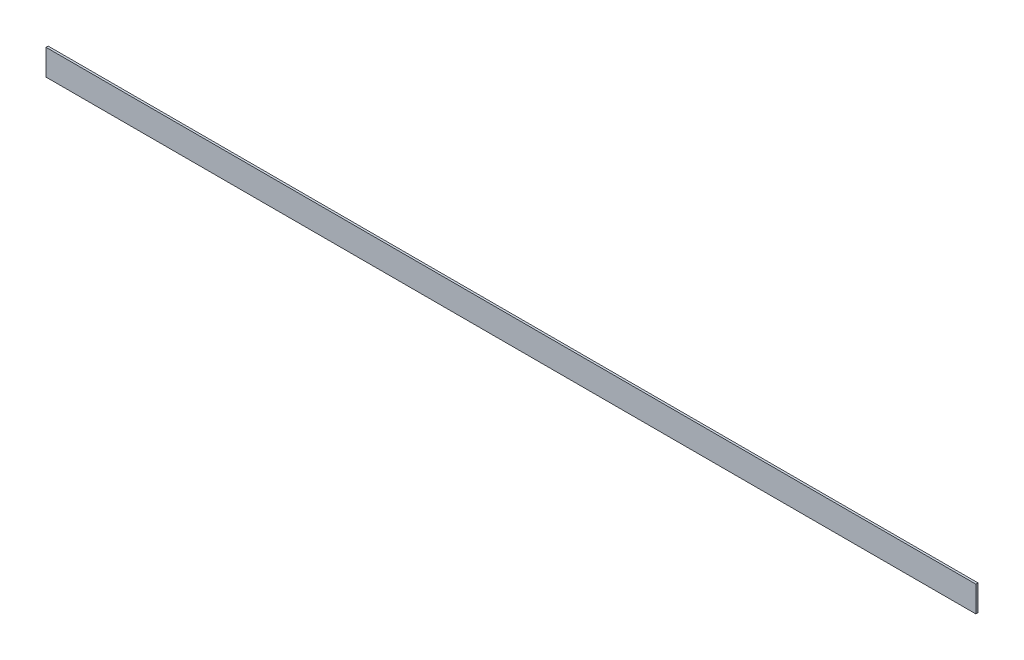
ISO-10303-21;
HEADER;
FILE_DESCRIPTION(('STEP AP214'),'2;1');
FILE_NAME('part.step','',(''),(''),'','','');
FILE_SCHEMA(('AUTOMOTIVE_DESIGN { 1 0 10303 214 1 1 1 1 }'));
ENDSEC;
DATA;
#1=APPLICATION_CONTEXT('core data for automotive mechanical design processes');
#2=APPLICATION_PROTOCOL_DEFINITION('international standard','automotive_design',2000,#1);
#3=PRODUCT_CONTEXT('',#1,'mechanical');
#4=PRODUCT('Part','Part','',(#3));
#5=PRODUCT_RELATED_PRODUCT_CATEGORY('part','',(#4));
#6=PRODUCT_DEFINITION_FORMATION('','',#4);
#7=PRODUCT_DEFINITION_CONTEXT('part definition',#1,'design');
#8=PRODUCT_DEFINITION('design','',#6,#7);
#9=PRODUCT_DEFINITION_SHAPE('','',#8);
#10=(LENGTH_UNIT() NAMED_UNIT(*) SI_UNIT(.MILLI.,.METRE.));
#11=(NAMED_UNIT(*) PLANE_ANGLE_UNIT() SI_UNIT($,.RADIAN.));
#12=(NAMED_UNIT(*) SI_UNIT($,.STERADIAN.) SOLID_ANGLE_UNIT());
#13=UNCERTAINTY_MEASURE_WITH_UNIT(LENGTH_MEASURE(1.E-05),#10,'distance_accuracy_value','');
#14=(GEOMETRIC_REPRESENTATION_CONTEXT(3) GLOBAL_UNCERTAINTY_ASSIGNED_CONTEXT((#13)) GLOBAL_UNIT_ASSIGNED_CONTEXT((#10,
#11,#12)) REPRESENTATION_CONTEXT('',''));
#15=CARTESIAN_POINT('',(0.,0.,0.));
#16=DIRECTION('',(0.,0.,1.));
#17=DIRECTION('',(1.,0.,0.));
#18=AXIS2_PLACEMENT_3D('',#15,#16,#17);
#19=CARTESIAN_POINT('',(2743.2,-38.1,-3.175));
#20=DIRECTION('',(0.,0.,1.));
#21=DIRECTION('',(1.,0.,0.));
#22=AXIS2_PLACEMENT_3D('',#19,#20,#21);
#23=PLANE('',#22);
#24=DIRECTION('',(0.,1.,0.));
#25=VECTOR('',#24,1.);
#26=CARTESIAN_POINT('',(0.,-38.1,-3.175));
#27=LINE('',#26,#25);
#28=CARTESIAN_POINT('',(0.,-38.1,-3.175));
#29=VERTEX_POINT('',#28);
#30=CARTESIAN_POINT('',(0.,38.1,-3.175));
#31=VERTEX_POINT('',#30);
#32=EDGE_CURVE('E98',#29,#31,#27,.T.);
#33=ORIENTED_EDGE('',*,*,#32,.T.);
#34=DIRECTION('',(-1.,0.,0.));
#35=VECTOR('',#34,1.);
#36=CARTESIAN_POINT('',(2743.2,38.1,-3.175));
#37=LINE('',#36,#35);
#38=CARTESIAN_POINT('',(2743.2,38.1,-3.175));
#39=VERTEX_POINT('',#38);
#40=EDGE_CURVE('E11',#39,#31,#37,.T.);
#41=ORIENTED_EDGE('',*,*,#40,.F.);
#42=DIRECTION('',(0.,1.,0.));
#43=VECTOR('',#42,1.);
#44=CARTESIAN_POINT('',(2743.2,-38.1,-3.175));
#45=LINE('',#44,#43);
#46=CARTESIAN_POINT('',(2743.2,-38.1,-3.175));
#47=VERTEX_POINT('',#46);
#48=EDGE_CURVE('E86',#47,#39,#45,.T.);
#49=ORIENTED_EDGE('',*,*,#48,.F.);
#50=DIRECTION('',(-1.,0.,0.));
#51=VECTOR('',#50,1.);
#52=CARTESIAN_POINT('',(2743.2,-38.1,-3.175));
#53=LINE('',#52,#51);
#54=EDGE_CURVE('E94',#47,#29,#53,.T.);
#55=ORIENTED_EDGE('',*,*,#54,.T.);
#56=EDGE_LOOP('',(#33,#41,#49,#55));
#57=FACE_BOUND('',#56,.T.);
#58=ADVANCED_FACE('F35',(#57),#23,.F.);
#59=CARTESIAN_POINT('',(2743.2,38.1,3.175));
#60=DIRECTION('',(0.,-1.,0.));
#61=DIRECTION('',(0.,0.,-1.));
#62=AXIS2_PLACEMENT_3D('',#59,#60,#61);
#63=PLANE('',#62);
#64=DIRECTION('',(0.,0.,1.));
#65=VECTOR('',#64,1.);
#66=CARTESIAN_POINT('',(0.,38.1,3.175));
#67=LINE('',#66,#65);
#68=CARTESIAN_POINT('',(0.,38.1,3.175));
#69=VERTEX_POINT('',#68);
#70=EDGE_CURVE('E90',#31,#69,#67,.T.);
#71=ORIENTED_EDGE('',*,*,#70,.T.);
#72=DIRECTION('',(-1.,0.,0.));
#73=VECTOR('',#72,1.);
#74=CARTESIAN_POINT('',(2743.2,38.1,3.175));
#75=LINE('',#74,#73);
#76=CARTESIAN_POINT('',(2743.2,38.1,3.175));
#77=VERTEX_POINT('',#76);
#78=EDGE_CURVE('E43',#77,#69,#75,.T.);
#79=ORIENTED_EDGE('',*,*,#78,.F.);
#80=DIRECTION('',(0.,0.,1.));
#81=VECTOR('',#80,1.);
#82=CARTESIAN_POINT('',(2743.2,38.1,3.175));
#83=LINE('',#82,#81);
#84=EDGE_CURVE('E81',#39,#77,#83,.T.);
#85=ORIENTED_EDGE('',*,*,#84,.F.);
#86=ORIENTED_EDGE('',*,*,#40,.T.);
#87=EDGE_LOOP('',(#71,#79,#85,#86));
#88=FACE_BOUND('',#87,.T.);
#89=ADVANCED_FACE('F89',(#88),#63,.F.);
#90=CARTESIAN_POINT('',(2743.2,-38.1,3.175));
#91=DIRECTION('',(0.,0.,-1.));
#92=DIRECTION('',(-1.,0.,0.));
#93=AXIS2_PLACEMENT_3D('',#90,#91,#92);
#94=PLANE('',#93);
#95=DIRECTION('',(0.,-1.,0.));
#96=VECTOR('',#95,1.);
#97=CARTESIAN_POINT('',(0.,-38.1,3.175));
#98=LINE('',#97,#96);
#99=CARTESIAN_POINT('',(0.,-38.1,3.175));
#100=VERTEX_POINT('',#99);
#101=EDGE_CURVE('E68',#69,#100,#98,.T.);
#102=ORIENTED_EDGE('',*,*,#101,.T.);
#103=DIRECTION('',(-1.,0.,0.));
#104=VECTOR('',#103,1.);
#105=CARTESIAN_POINT('',(2743.2,-38.1,3.175));
#106=LINE('',#105,#104);
#107=CARTESIAN_POINT('',(2743.2,-38.1,3.175));
#108=VERTEX_POINT('',#107);
#109=EDGE_CURVE('E91',#108,#100,#106,.T.);
#110=ORIENTED_EDGE('',*,*,#109,.F.);
#111=DIRECTION('',(0.,-1.,0.));
#112=VECTOR('',#111,1.);
#113=CARTESIAN_POINT('',(2743.2,-38.1,3.175));
#114=LINE('',#113,#112);
#115=EDGE_CURVE('E84',#77,#108,#114,.T.);
#116=ORIENTED_EDGE('',*,*,#115,.F.);
#117=ORIENTED_EDGE('',*,*,#78,.T.);
#118=EDGE_LOOP('',(#102,#110,#116,#117));
#119=FACE_BOUND('',#118,.T.);
#120=ADVANCED_FACE('F92',(#119),#94,.F.);
#121=CARTESIAN_POINT('',(2743.2,-38.1,3.175));
#122=DIRECTION('',(0.,1.,0.));
#123=DIRECTION('',(0.,0.,1.));
#124=AXIS2_PLACEMENT_3D('',#121,#122,#123);
#125=PLANE('',#124);
#126=DIRECTION('',(0.,0.,-1.));
#127=VECTOR('',#126,1.);
#128=CARTESIAN_POINT('',(0.,-38.1,3.175));
#129=LINE('',#128,#127);
#130=EDGE_CURVE('E74',#100,#29,#129,.T.);
#131=ORIENTED_EDGE('',*,*,#130,.T.);
#132=ORIENTED_EDGE('',*,*,#54,.F.);
#133=DIRECTION('',(0.,0.,-1.));
#134=VECTOR('',#133,1.);
#135=CARTESIAN_POINT('',(2743.2,-38.1,3.175));
#136=LINE('',#135,#134);
#137=EDGE_CURVE('E51',#108,#47,#136,.T.);
#138=ORIENTED_EDGE('',*,*,#137,.F.);
#139=ORIENTED_EDGE('',*,*,#109,.T.);
#140=EDGE_LOOP('',(#131,#132,#138,#139));
#141=FACE_BOUND('',#140,.T.);
#142=ADVANCED_FACE('F105',(#141),#125,.F.);
#143=CARTESIAN_POINT('',(2743.2,0.,0.));
#144=DIRECTION('',(-1.,0.,0.));
#145=DIRECTION('',(0.,0.,1.));
#146=AXIS2_PLACEMENT_3D('',#143,#144,#145);
#147=PLANE('',#146);
#148=ORIENTED_EDGE('',*,*,#48,.T.);
#149=ORIENTED_EDGE('',*,*,#84,.T.);
#150=ORIENTED_EDGE('',*,*,#115,.T.);
#151=ORIENTED_EDGE('',*,*,#137,.T.);
#152=EDGE_LOOP('',(#148,#149,#150,#151));
#153=FACE_BOUND('',#152,.T.);
#154=ADVANCED_FACE('F82',(#153),#147,.F.);
#155=CARTESIAN_POINT('',(0.,0.,0.));
#156=DIRECTION('',(-1.,0.,0.));
#157=DIRECTION('',(0.,0.,1.));
#158=AXIS2_PLACEMENT_3D('',#155,#156,#157);
#159=PLANE('',#158);
#160=ORIENTED_EDGE('',*,*,#32,.F.);
#161=ORIENTED_EDGE('',*,*,#130,.F.);
#162=ORIENTED_EDGE('',*,*,#101,.F.);
#163=ORIENTED_EDGE('',*,*,#70,.F.);
#164=EDGE_LOOP('',(#160,#161,#162,#163));
#165=FACE_BOUND('',#164,.T.);
#166=ADVANCED_FACE('F108',(#165),#159,.T.);
#167=CLOSED_SHELL('',(#58,#89,#120,#142,#154,#166));
#168=MANIFOLD_SOLID_BREP('B2',#167);
#169=ADVANCED_BREP_SHAPE_REPRESENTATION('',(#18,#168),#14);
#170=SHAPE_DEFINITION_REPRESENTATION(#9,#169);
ENDSEC;
END-ISO-10303-21;
